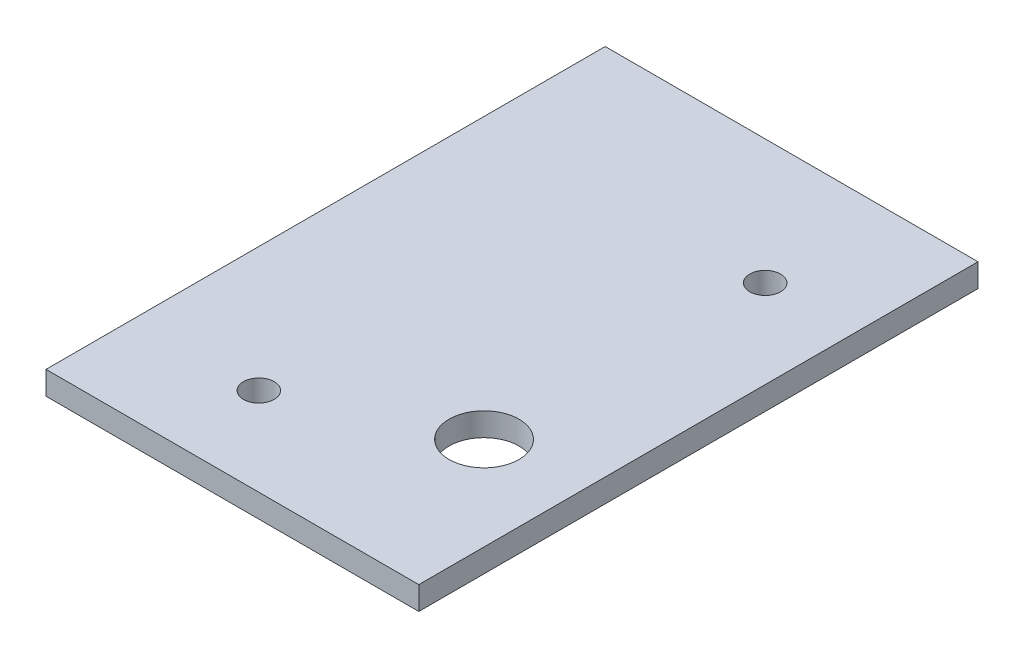
ISO-10303-21;
HEADER;
FILE_DESCRIPTION(('STEP AP214'),'2;1');
FILE_NAME('part.step','',(''),(''),'','','');
FILE_SCHEMA(('AUTOMOTIVE_DESIGN { 1 0 10303 214 1 1 1 1 }'));
ENDSEC;
DATA;
#1=APPLICATION_CONTEXT('core data for automotive mechanical design processes');
#2=APPLICATION_PROTOCOL_DEFINITION('international standard','automotive_design',2000,#1);
#3=PRODUCT_CONTEXT('',#1,'mechanical');
#4=PRODUCT('Part','Part','',(#3));
#5=PRODUCT_RELATED_PRODUCT_CATEGORY('part','',(#4));
#6=PRODUCT_DEFINITION_FORMATION('','',#4);
#7=PRODUCT_DEFINITION_CONTEXT('part definition',#1,'design');
#8=PRODUCT_DEFINITION('design','',#6,#7);
#9=PRODUCT_DEFINITION_SHAPE('','',#8);
#10=(LENGTH_UNIT() NAMED_UNIT(*) SI_UNIT(.MILLI.,.METRE.));
#11=(NAMED_UNIT(*) PLANE_ANGLE_UNIT() SI_UNIT($,.RADIAN.));
#12=(NAMED_UNIT(*) SI_UNIT($,.STERADIAN.) SOLID_ANGLE_UNIT());
#13=UNCERTAINTY_MEASURE_WITH_UNIT(LENGTH_MEASURE(1.E-05),#10,'distance_accuracy_value','');
#14=(GEOMETRIC_REPRESENTATION_CONTEXT(3) GLOBAL_UNCERTAINTY_ASSIGNED_CONTEXT((#13)) GLOBAL_UNIT_ASSIGNED_CONTEXT((#10,
#11,#12)) REPRESENTATION_CONTEXT('',''));
#15=CARTESIAN_POINT('',(0.,0.,0.));
#16=DIRECTION('',(0.,0.,1.));
#17=DIRECTION('',(1.,0.,0.));
#18=AXIS2_PLACEMENT_3D('',#15,#16,#17);
#19=CARTESIAN_POINT('',(-25.4,3.175,-38.1));
#20=DIRECTION('',(1.,0.,0.));
#21=DIRECTION('',(0.,0.,-1.));
#22=AXIS2_PLACEMENT_3D('',#19,#20,#21);
#23=PLANE('',#22);
#24=DIRECTION('',(0.,0.,1.));
#25=VECTOR('',#24,1.);
#26=CARTESIAN_POINT('',(-25.4,0.,-38.1));
#27=LINE('',#26,#25);
#28=CARTESIAN_POINT('',(-25.4,0.,-38.1));
#29=VERTEX_POINT('',#28);
#30=CARTESIAN_POINT('',(-25.4,0.,38.1));
#31=VERTEX_POINT('',#30);
#32=EDGE_CURVE('E102',#29,#31,#27,.T.);
#33=ORIENTED_EDGE('',*,*,#32,.T.);
#34=DIRECTION('',(0.,-1.,0.));
#35=VECTOR('',#34,1.);
#36=CARTESIAN_POINT('',(-25.4,3.175,38.1));
#37=LINE('',#36,#35);
#38=CARTESIAN_POINT('',(-25.4,3.175,38.1));
#39=VERTEX_POINT('',#38);
#40=EDGE_CURVE('E11',#39,#31,#37,.T.);
#41=ORIENTED_EDGE('',*,*,#40,.F.);
#42=DIRECTION('',(0.,0.,1.));
#43=VECTOR('',#42,1.);
#44=CARTESIAN_POINT('',(-25.4,3.175,-38.1));
#45=LINE('',#44,#43);
#46=CARTESIAN_POINT('',(-25.4,3.175,-38.1));
#47=VERTEX_POINT('',#46);
#48=EDGE_CURVE('E90',#47,#39,#45,.T.);
#49=ORIENTED_EDGE('',*,*,#48,.F.);
#50=DIRECTION('',(0.,-1.,0.));
#51=VECTOR('',#50,1.);
#52=CARTESIAN_POINT('',(-25.4,3.175,-38.1));
#53=LINE('',#52,#51);
#54=EDGE_CURVE('E98',#47,#29,#53,.T.);
#55=ORIENTED_EDGE('',*,*,#54,.T.);
#56=EDGE_LOOP('',(#33,#41,#49,#55));
#57=FACE_BOUND('',#56,.T.);
#58=ADVANCED_FACE('F39',(#57),#23,.F.);
#59=CARTESIAN_POINT('',(-25.4,3.175,38.1));
#60=DIRECTION('',(0.,0.,-1.));
#61=DIRECTION('',(-1.,0.,0.));
#62=AXIS2_PLACEMENT_3D('',#59,#60,#61);
#63=PLANE('',#62);
#64=DIRECTION('',(1.,0.,0.));
#65=VECTOR('',#64,1.);
#66=CARTESIAN_POINT('',(-25.4,0.,38.1));
#67=LINE('',#66,#65);
#68=CARTESIAN_POINT('',(25.4,0.,38.1));
#69=VERTEX_POINT('',#68);
#70=EDGE_CURVE('E94',#31,#69,#67,.T.);
#71=ORIENTED_EDGE('',*,*,#70,.T.);
#72=DIRECTION('',(0.,-1.,0.));
#73=VECTOR('',#72,1.);
#74=CARTESIAN_POINT('',(25.4,3.175,38.1));
#75=LINE('',#74,#73);
#76=CARTESIAN_POINT('',(25.4,3.175,38.1));
#77=VERTEX_POINT('',#76);
#78=EDGE_CURVE('E47',#77,#69,#75,.T.);
#79=ORIENTED_EDGE('',*,*,#78,.F.);
#80=DIRECTION('',(1.,0.,0.));
#81=VECTOR('',#80,1.);
#82=CARTESIAN_POINT('',(-25.4,3.175,38.1));
#83=LINE('',#82,#81);
#84=EDGE_CURVE('E85',#39,#77,#83,.T.);
#85=ORIENTED_EDGE('',*,*,#84,.F.);
#86=ORIENTED_EDGE('',*,*,#40,.T.);
#87=EDGE_LOOP('',(#71,#79,#85,#86));
#88=FACE_BOUND('',#87,.T.);
#89=ADVANCED_FACE('F93',(#88),#63,.F.);
#90=CARTESIAN_POINT('',(25.4,3.175,-38.1));
#91=DIRECTION('',(-1.,0.,0.));
#92=DIRECTION('',(0.,0.,1.));
#93=AXIS2_PLACEMENT_3D('',#90,#91,#92);
#94=PLANE('',#93);
#95=DIRECTION('',(0.,0.,-1.));
#96=VECTOR('',#95,1.);
#97=CARTESIAN_POINT('',(25.4,0.,-38.1));
#98=LINE('',#97,#96);
#99=CARTESIAN_POINT('',(25.4,0.,-38.1));
#100=VERTEX_POINT('',#99);
#101=EDGE_CURVE('E72',#69,#100,#98,.T.);
#102=ORIENTED_EDGE('',*,*,#101,.T.);
#103=DIRECTION('',(0.,-1.,0.));
#104=VECTOR('',#103,1.);
#105=CARTESIAN_POINT('',(25.4,3.175,-38.1));
#106=LINE('',#105,#104);
#107=CARTESIAN_POINT('',(25.4,3.175,-38.1));
#108=VERTEX_POINT('',#107);
#109=EDGE_CURVE('E95',#108,#100,#106,.T.);
#110=ORIENTED_EDGE('',*,*,#109,.F.);
#111=DIRECTION('',(0.,0.,-1.));
#112=VECTOR('',#111,1.);
#113=CARTESIAN_POINT('',(25.4,3.175,-38.1));
#114=LINE('',#113,#112);
#115=EDGE_CURVE('E88',#77,#108,#114,.T.);
#116=ORIENTED_EDGE('',*,*,#115,.F.);
#117=ORIENTED_EDGE('',*,*,#78,.T.);
#118=EDGE_LOOP('',(#102,#110,#116,#117));
#119=FACE_BOUND('',#118,.T.);
#120=ADVANCED_FACE('F96',(#119),#94,.F.);
#121=CARTESIAN_POINT('',(-25.4,3.175,-38.1));
#122=DIRECTION('',(0.,0.,1.));
#123=DIRECTION('',(1.,0.,0.));
#124=AXIS2_PLACEMENT_3D('',#121,#122,#123);
#125=PLANE('',#124);
#126=DIRECTION('',(-1.,0.,0.));
#127=VECTOR('',#126,1.);
#128=CARTESIAN_POINT('',(-25.4,0.,-38.1));
#129=LINE('',#128,#127);
#130=EDGE_CURVE('E78',#100,#29,#129,.T.);
#131=ORIENTED_EDGE('',*,*,#130,.T.);
#132=ORIENTED_EDGE('',*,*,#54,.F.);
#133=DIRECTION('',(-1.,0.,0.));
#134=VECTOR('',#133,1.);
#135=CARTESIAN_POINT('',(-25.4,3.175,-38.1));
#136=LINE('',#135,#134);
#137=EDGE_CURVE('E55',#108,#47,#136,.T.);
#138=ORIENTED_EDGE('',*,*,#137,.F.);
#139=ORIENTED_EDGE('',*,*,#109,.T.);
#140=EDGE_LOOP('',(#131,#132,#138,#139));
#141=FACE_BOUND('',#140,.T.);
#142=ADVANCED_FACE('F110',(#141),#125,.F.);
#143=CARTESIAN_POINT('',(0.,3.175,0.));
#144=DIRECTION('',(0.,1.,0.));
#145=DIRECTION('',(0.,0.,1.));
#146=AXIS2_PLACEMENT_3D('',#143,#144,#145);
#147=PLANE('',#146);
#148=CARTESIAN_POINT('',(13.4,3.175,-21.1));
#149=DIRECTION('',(0.,1.,0.));
#150=DIRECTION('',(0.,0.,1.));
#151=AXIS2_PLACEMENT_3D('',#148,#149,#150);
#152=CIRCLE('',#151,2.1);
#153=CARTESIAN_POINT('',(13.4,3.175,-19.));
#154=VERTEX_POINT('',#153);
#155=EDGE_CURVE('E128',#154,#154,#152,.T.);
#156=ORIENTED_EDGE('',*,*,#155,.F.);
#157=EDGE_LOOP('',(#156));
#158=FACE_BOUND('',#157,.T.);
#159=CARTESIAN_POINT('',(-8.4,3.175,26.1));
#160=DIRECTION('',(0.,1.,0.));
#161=DIRECTION('',(0.,0.,1.));
#162=AXIS2_PLACEMENT_3D('',#159,#160,#161);
#163=CIRCLE('',#162,2.1);
#164=CARTESIAN_POINT('',(-8.4,3.175,28.2));
#165=VERTEX_POINT('',#164);
#166=EDGE_CURVE('E125',#165,#165,#163,.T.);
#167=ORIENTED_EDGE('',*,*,#166,.F.);
#168=EDGE_LOOP('',(#167));
#169=FACE_BOUND('',#168,.T.);
#170=CARTESIAN_POINT('',(12.7,3.175,16.51));
#171=DIRECTION('',(0.,1.,0.));
#172=DIRECTION('',(0.,0.,1.));
#173=AXIS2_PLACEMENT_3D('',#170,#171,#172);
#174=CIRCLE('',#173,4.7625);
#175=CARTESIAN_POINT('',(12.7,3.175,21.2725));
#176=VERTEX_POINT('',#175);
#177=EDGE_CURVE('E116',#176,#176,#174,.T.);
#178=ORIENTED_EDGE('',*,*,#177,.F.);
#179=EDGE_LOOP('',(#178));
#180=FACE_BOUND('',#179,.T.);
#181=ORIENTED_EDGE('',*,*,#48,.T.);
#182=ORIENTED_EDGE('',*,*,#84,.T.);
#183=ORIENTED_EDGE('',*,*,#115,.T.);
#184=ORIENTED_EDGE('',*,*,#137,.T.);
#185=EDGE_LOOP('',(#181,#182,#183,#184));
#186=FACE_BOUND('',#185,.T.);
#187=ADVANCED_FACE('F86',(#158,#169,#180,#186),#147,.T.);
#188=CARTESIAN_POINT('',(0.,0.,0.));
#189=DIRECTION('',(0.,1.,0.));
#190=DIRECTION('',(0.,0.,1.));
#191=AXIS2_PLACEMENT_3D('',#188,#189,#190);
#192=PLANE('',#191);
#193=CARTESIAN_POINT('',(13.4,0.,-21.1));
#194=DIRECTION('',(0.,1.,0.));
#195=DIRECTION('',(0.,0.,1.));
#196=AXIS2_PLACEMENT_3D('',#193,#194,#195);
#197=CIRCLE('',#196,2.1);
#198=CARTESIAN_POINT('',(13.4,0.,-19.));
#199=VERTEX_POINT('',#198);
#200=EDGE_CURVE('E119',#199,#199,#197,.T.);
#201=ORIENTED_EDGE('',*,*,#200,.T.);
#202=EDGE_LOOP('',(#201));
#203=FACE_BOUND('',#202,.T.);
#204=CARTESIAN_POINT('',(-8.4,0.,26.1));
#205=DIRECTION('',(0.,1.,0.));
#206=DIRECTION('',(0.,0.,1.));
#207=AXIS2_PLACEMENT_3D('',#204,#205,#206);
#208=CIRCLE('',#207,2.1);
#209=CARTESIAN_POINT('',(-8.4,0.,28.2));
#210=VERTEX_POINT('',#209);
#211=EDGE_CURVE('E122',#210,#210,#208,.T.);
#212=ORIENTED_EDGE('',*,*,#211,.T.);
#213=EDGE_LOOP('',(#212));
#214=FACE_BOUND('',#213,.T.);
#215=CARTESIAN_POINT('',(12.7,0.,16.51));
#216=DIRECTION('',(0.,1.,0.));
#217=DIRECTION('',(0.,0.,1.));
#218=AXIS2_PLACEMENT_3D('',#215,#216,#217);
#219=CIRCLE('',#218,4.7625);
#220=CARTESIAN_POINT('',(12.7,0.,21.2725));
#221=VERTEX_POINT('',#220);
#222=EDGE_CURVE('E105',#221,#221,#219,.T.);
#223=ORIENTED_EDGE('',*,*,#222,.T.);
#224=EDGE_LOOP('',(#223));
#225=FACE_BOUND('',#224,.T.);
#226=ORIENTED_EDGE('',*,*,#32,.F.);
#227=ORIENTED_EDGE('',*,*,#130,.F.);
#228=ORIENTED_EDGE('',*,*,#101,.F.);
#229=ORIENTED_EDGE('',*,*,#70,.F.);
#230=EDGE_LOOP('',(#226,#227,#228,#229));
#231=FACE_BOUND('',#230,.T.);
#232=ADVANCED_FACE('F113',(#203,#214,#225,#231),#192,.F.);
#233=CARTESIAN_POINT('',(12.7,0.,16.51));
#234=DIRECTION('',(0.,1.,0.));
#235=DIRECTION('',(0.,0.,1.));
#236=AXIS2_PLACEMENT_3D('',#233,#234,#235);
#237=CYLINDRICAL_SURFACE('',#236,4.7625);
#238=ORIENTED_EDGE('',*,*,#222,.F.);
#239=EDGE_LOOP('',(#238));
#240=FACE_BOUND('',#239,.T.);
#241=ORIENTED_EDGE('',*,*,#177,.T.);
#242=EDGE_LOOP('',(#241));
#243=FACE_BOUND('',#242,.T.);
#244=ADVANCED_FACE('F150',(#240,#243),#237,.F.);
#245=CARTESIAN_POINT('',(-8.4,0.,26.1));
#246=DIRECTION('',(0.,1.,0.));
#247=DIRECTION('',(0.,0.,1.));
#248=AXIS2_PLACEMENT_3D('',#245,#246,#247);
#249=CYLINDRICAL_SURFACE('',#248,2.1);
#250=ORIENTED_EDGE('',*,*,#211,.F.);
#251=EDGE_LOOP('',(#250));
#252=FACE_BOUND('',#251,.T.);
#253=ORIENTED_EDGE('',*,*,#166,.T.);
#254=EDGE_LOOP('',(#253));
#255=FACE_BOUND('',#254,.T.);
#256=ADVANCED_FACE('F139',(#252,#255),#249,.F.);
#257=CARTESIAN_POINT('',(13.4,0.,-21.1));
#258=DIRECTION('',(0.,1.,0.));
#259=DIRECTION('',(0.,0.,1.));
#260=AXIS2_PLACEMENT_3D('',#257,#258,#259);
#261=CYLINDRICAL_SURFACE('',#260,2.1);
#262=ORIENTED_EDGE('',*,*,#200,.F.);
#263=EDGE_LOOP('',(#262));
#264=FACE_BOUND('',#263,.T.);
#265=ORIENTED_EDGE('',*,*,#155,.T.);
#266=EDGE_LOOP('',(#265));
#267=FACE_BOUND('',#266,.T.);
#268=ADVANCED_FACE('F136',(#264,#267),#261,.F.);
#269=CLOSED_SHELL('',(#58,#89,#120,#142,#187,#232,#244,#256,#268));
#270=MANIFOLD_SOLID_BREP('B2',#269);
#271=ADVANCED_BREP_SHAPE_REPRESENTATION('',(#18,#270),#14);
#272=SHAPE_DEFINITION_REPRESENTATION(#9,#271);
ENDSEC;
END-ISO-10303-21;
